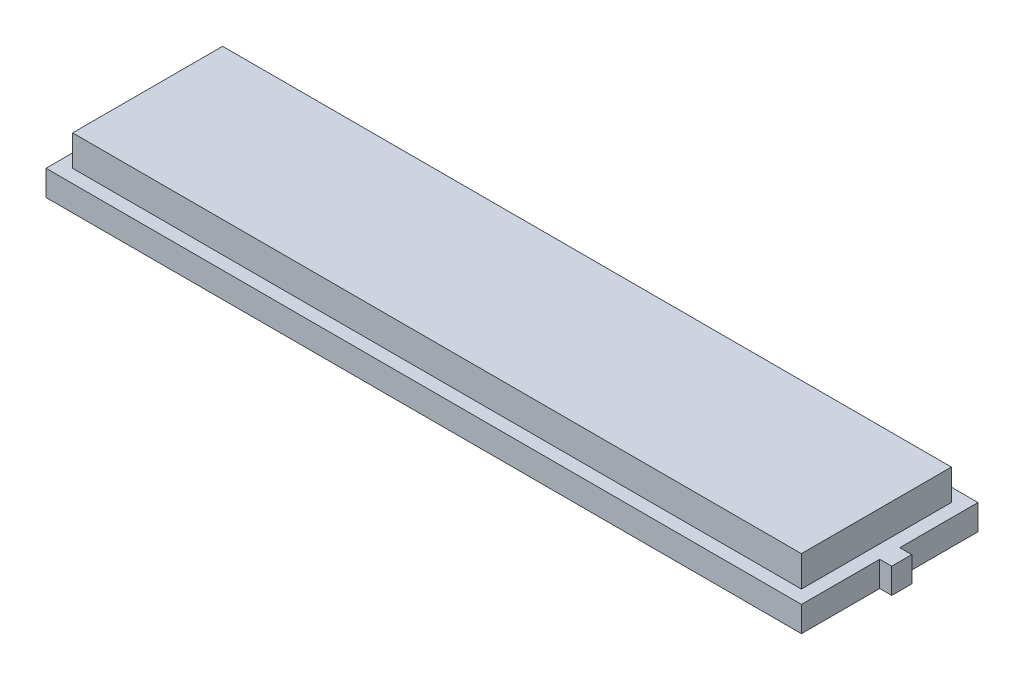
ISO-10303-21;
HEADER;
FILE_DESCRIPTION(('STEP AP214'),'2;1');
FILE_NAME('part.step','',(''),(''),'','','');
FILE_SCHEMA(('AUTOMOTIVE_DESIGN { 1 0 10303 214 1 1 1 1 }'));
ENDSEC;
DATA;
#1=APPLICATION_CONTEXT('core data for automotive mechanical design processes');
#2=APPLICATION_PROTOCOL_DEFINITION('international standard','automotive_design',2000,#1);
#3=PRODUCT_CONTEXT('',#1,'mechanical');
#4=PRODUCT('Part','Part','',(#3));
#5=PRODUCT_RELATED_PRODUCT_CATEGORY('part','',(#4));
#6=PRODUCT_DEFINITION_FORMATION('','',#4);
#7=PRODUCT_DEFINITION_CONTEXT('part definition',#1,'design');
#8=PRODUCT_DEFINITION('design','',#6,#7);
#9=PRODUCT_DEFINITION_SHAPE('','',#8);
#10=(LENGTH_UNIT() NAMED_UNIT(*) SI_UNIT(.MILLI.,.METRE.));
#11=(NAMED_UNIT(*) PLANE_ANGLE_UNIT() SI_UNIT($,.RADIAN.));
#12=(NAMED_UNIT(*) SI_UNIT($,.STERADIAN.) SOLID_ANGLE_UNIT());
#13=UNCERTAINTY_MEASURE_WITH_UNIT(LENGTH_MEASURE(1.E-05),#10,'distance_accuracy_value','');
#14=(GEOMETRIC_REPRESENTATION_CONTEXT(3) GLOBAL_UNCERTAINTY_ASSIGNED_CONTEXT((#13)) GLOBAL_UNIT_ASSIGNED_CONTEXT((#10,
#11,#12)) REPRESENTATION_CONTEXT('',''));
#15=CARTESIAN_POINT('',(0.,0.,0.));
#16=DIRECTION('',(0.,0.,1.));
#17=DIRECTION('',(1.,0.,0.));
#18=AXIS2_PLACEMENT_3D('',#15,#16,#17);
#19=CARTESIAN_POINT('',(0.,1.9,0.));
#20=DIRECTION('',(0.,1.,0.));
#21=DIRECTION('',(0.,0.,1.));
#22=AXIS2_PLACEMENT_3D('',#19,#20,#21);
#23=PLANE('',#22);
#24=DIRECTION('',(0.,0.,1.));
#25=VECTOR('',#24,1.);
#26=CARTESIAN_POINT('',(-28.31,1.9,-6.615));
#27=LINE('',#26,#25);
#28=CARTESIAN_POINT('',(-28.31,1.9,-6.615));
#29=VERTEX_POINT('',#28);
#30=CARTESIAN_POINT('',(-28.31,1.9,6.615));
#31=VERTEX_POINT('',#30);
#32=EDGE_CURVE('E159',#29,#31,#27,.T.);
#33=ORIENTED_EDGE('',*,*,#32,.T.);
#34=DIRECTION('',(1.,0.,0.));
#35=VECTOR('',#34,1.);
#36=CARTESIAN_POINT('',(-28.31,1.9,6.615));
#37=LINE('',#36,#35);
#38=CARTESIAN_POINT('',(28.31,1.9,6.615));
#39=VERTEX_POINT('',#38);
#40=EDGE_CURVE('E99',#31,#39,#37,.T.);
#41=ORIENTED_EDGE('',*,*,#40,.T.);
#42=DIRECTION('',(0.,0.,-1.));
#43=VECTOR('',#42,1.);
#44=CARTESIAN_POINT('',(28.31,1.9,0.75));
#45=LINE('',#44,#43);
#46=CARTESIAN_POINT('',(28.31,1.9,0.75));
#47=VERTEX_POINT('',#46);
#48=EDGE_CURVE('E174',#39,#47,#45,.T.);
#49=ORIENTED_EDGE('',*,*,#48,.T.);
#50=DIRECTION('',(1.,0.,0.));
#51=VECTOR('',#50,1.);
#52=CARTESIAN_POINT('',(29.21,1.9,0.75));
#53=LINE('',#52,#51);
#54=CARTESIAN_POINT('',(29.21,1.9,0.75));
#55=VERTEX_POINT('',#54);
#56=EDGE_CURVE('E186',#47,#55,#53,.T.);
#57=ORIENTED_EDGE('',*,*,#56,.T.);
#58=DIRECTION('',(0.,0.,-1.));
#59=VECTOR('',#58,1.);
#60=CARTESIAN_POINT('',(29.21,1.9,-0.75));
#61=LINE('',#60,#59);
#62=CARTESIAN_POINT('',(29.21,1.9,-0.75));
#63=VERTEX_POINT('',#62);
#64=EDGE_CURVE('E122',#55,#63,#61,.T.);
#65=ORIENTED_EDGE('',*,*,#64,.T.);
#66=DIRECTION('',(-1.,0.,0.));
#67=VECTOR('',#66,1.);
#68=CARTESIAN_POINT('',(28.31,1.9,-0.75));
#69=LINE('',#68,#67);
#70=CARTESIAN_POINT('',(28.31,1.9,-0.75));
#71=VERTEX_POINT('',#70);
#72=EDGE_CURVE('E115',#63,#71,#69,.T.);
#73=ORIENTED_EDGE('',*,*,#72,.T.);
#74=DIRECTION('',(0.,0.,-1.));
#75=VECTOR('',#74,1.);
#76=CARTESIAN_POINT('',(28.31,1.9,-6.615));
#77=LINE('',#76,#75);
#78=CARTESIAN_POINT('',(28.31,1.9,-6.615));
#79=VERTEX_POINT('',#78);
#80=EDGE_CURVE('E119',#71,#79,#77,.T.);
#81=ORIENTED_EDGE('',*,*,#80,.T.);
#82=DIRECTION('',(-1.,0.,0.));
#83=VECTOR('',#82,1.);
#84=CARTESIAN_POINT('',(-28.31,1.9,-6.615));
#85=LINE('',#84,#83);
#86=EDGE_CURVE('E58',#79,#29,#85,.T.);
#87=ORIENTED_EDGE('',*,*,#86,.T.);
#88=EDGE_LOOP('',(#33,#41,#49,#57,#65,#73,#81,#87));
#89=FACE_BOUND('',#88,.T.);
#90=DIRECTION('',(1.,0.,0.));
#91=VECTOR('',#90,1.);
#92=CARTESIAN_POINT('',(-27.31,1.9,5.62));
#93=LINE('',#92,#91);
#94=CARTESIAN_POINT('',(-27.31,1.9,5.62));
#95=VERTEX_POINT('',#94);
#96=CARTESIAN_POINT('',(27.31,1.9,5.62));
#97=VERTEX_POINT('',#96);
#98=EDGE_CURVE('E207',#95,#97,#93,.T.);
#99=ORIENTED_EDGE('',*,*,#98,.F.);
#100=DIRECTION('',(0.,0.,1.));
#101=VECTOR('',#100,1.);
#102=CARTESIAN_POINT('',(-27.31,1.9,-5.62));
#103=LINE('',#102,#101);
#104=CARTESIAN_POINT('',(-27.31,1.9,-5.62));
#105=VERTEX_POINT('',#104);
#106=EDGE_CURVE('E210',#105,#95,#103,.T.);
#107=ORIENTED_EDGE('',*,*,#106,.F.);
#108=DIRECTION('',(-1.,0.,0.));
#109=VECTOR('',#108,1.);
#110=CARTESIAN_POINT('',(-27.31,1.9,-5.62));
#111=LINE('',#110,#109);
#112=CARTESIAN_POINT('',(27.31,1.9,-5.62));
#113=VERTEX_POINT('',#112);
#114=EDGE_CURVE('E202',#113,#105,#111,.T.);
#115=ORIENTED_EDGE('',*,*,#114,.F.);
#116=DIRECTION('',(0.,0.,-1.));
#117=VECTOR('',#116,1.);
#118=CARTESIAN_POINT('',(27.31,1.9,-5.62));
#119=LINE('',#118,#117);
#120=EDGE_CURVE('E205',#97,#113,#119,.T.);
#121=ORIENTED_EDGE('',*,*,#120,.F.);
#122=EDGE_LOOP('',(#99,#107,#115,#121));
#123=FACE_BOUND('',#122,.T.);
#124=ADVANCED_FACE('F34',(#89,#123),#23,.T.);
#125=CARTESIAN_POINT('',(-28.31,1.9,-6.615));
#126=DIRECTION('',(1.,0.,0.));
#127=DIRECTION('',(0.,0.,-1.));
#128=AXIS2_PLACEMENT_3D('',#125,#126,#127);
#129=PLANE('',#128);
#130=DIRECTION('',(0.,0.,1.));
#131=VECTOR('',#130,1.);
#132=CARTESIAN_POINT('',(-28.31,0.,-6.615));
#133=LINE('',#132,#131);
#134=CARTESIAN_POINT('',(-28.31,0.,-6.615));
#135=VERTEX_POINT('',#134);
#136=CARTESIAN_POINT('',(-28.31,0.,6.615));
#137=VERTEX_POINT('',#136);
#138=EDGE_CURVE('E143',#135,#137,#133,.T.);
#139=ORIENTED_EDGE('',*,*,#138,.T.);
#140=DIRECTION('',(0.,-1.,0.));
#141=VECTOR('',#140,1.);
#142=CARTESIAN_POINT('',(-28.31,1.9,6.615));
#143=LINE('',#142,#141);
#144=EDGE_CURVE('E11',#31,#137,#143,.T.);
#145=ORIENTED_EDGE('',*,*,#144,.F.);
#146=ORIENTED_EDGE('',*,*,#32,.F.);
#147=DIRECTION('',(0.,-1.,0.));
#148=VECTOR('',#147,1.);
#149=CARTESIAN_POINT('',(-28.31,1.9,-6.615));
#150=LINE('',#149,#148);
#151=EDGE_CURVE('E139',#29,#135,#150,.T.);
#152=ORIENTED_EDGE('',*,*,#151,.T.);
#153=EDGE_LOOP('',(#139,#145,#146,#152));
#154=FACE_BOUND('',#153,.T.);
#155=ADVANCED_FACE('F36',(#154),#129,.F.);
#156=CARTESIAN_POINT('',(-28.31,1.9,6.615));
#157=DIRECTION('',(0.,0.,-1.));
#158=DIRECTION('',(-1.,0.,0.));
#159=AXIS2_PLACEMENT_3D('',#156,#157,#158);
#160=PLANE('',#159);
#161=DIRECTION('',(1.,0.,0.));
#162=VECTOR('',#161,1.);
#163=CARTESIAN_POINT('',(-28.31,0.,6.615));
#164=LINE('',#163,#162);
#165=CARTESIAN_POINT('',(28.31,0.,6.615));
#166=VERTEX_POINT('',#165);
#167=EDGE_CURVE('E146',#137,#166,#164,.T.);
#168=ORIENTED_EDGE('',*,*,#167,.T.);
#169=DIRECTION('',(0.,-1.,0.));
#170=VECTOR('',#169,1.);
#171=CARTESIAN_POINT('',(28.31,1.9,6.615));
#172=LINE('',#171,#170);
#173=EDGE_CURVE('E42',#39,#166,#172,.T.);
#174=ORIENTED_EDGE('',*,*,#173,.F.);
#175=ORIENTED_EDGE('',*,*,#40,.F.);
#176=ORIENTED_EDGE('',*,*,#144,.T.);
#177=EDGE_LOOP('',(#168,#174,#175,#176));
#178=FACE_BOUND('',#177,.T.);
#179=ADVANCED_FACE('F256',(#178),#160,.F.);
#180=CARTESIAN_POINT('',(28.31,1.9,0.75));
#181=DIRECTION('',(-1.,0.,0.));
#182=DIRECTION('',(0.,0.,1.));
#183=AXIS2_PLACEMENT_3D('',#180,#181,#182);
#184=PLANE('',#183);
#185=DIRECTION('',(0.,0.,-1.));
#186=VECTOR('',#185,1.);
#187=CARTESIAN_POINT('',(28.31,0.,0.75));
#188=LINE('',#187,#186);
#189=CARTESIAN_POINT('',(28.31,0.,0.75));
#190=VERTEX_POINT('',#189);
#191=EDGE_CURVE('E149',#166,#190,#188,.T.);
#192=ORIENTED_EDGE('',*,*,#191,.T.);
#193=DIRECTION('',(0.,-1.,0.));
#194=VECTOR('',#193,1.);
#195=CARTESIAN_POINT('',(28.31,1.9,0.75));
#196=LINE('',#195,#194);
#197=EDGE_CURVE('E166',#47,#190,#196,.T.);
#198=ORIENTED_EDGE('',*,*,#197,.F.);
#199=ORIENTED_EDGE('',*,*,#48,.F.);
#200=ORIENTED_EDGE('',*,*,#173,.T.);
#201=EDGE_LOOP('',(#192,#198,#199,#200));
#202=FACE_BOUND('',#201,.T.);
#203=ADVANCED_FACE('F172',(#202),#184,.F.);
#204=CARTESIAN_POINT('',(29.21,1.9,0.75));
#205=DIRECTION('',(0.,0.,-1.));
#206=DIRECTION('',(-1.,0.,0.));
#207=AXIS2_PLACEMENT_3D('',#204,#205,#206);
#208=PLANE('',#207);
#209=DIRECTION('',(1.,0.,0.));
#210=VECTOR('',#209,1.);
#211=CARTESIAN_POINT('',(29.21,0.,0.75));
#212=LINE('',#211,#210);
#213=CARTESIAN_POINT('',(29.21,0.,0.75));
#214=VERTEX_POINT('',#213);
#215=EDGE_CURVE('E151',#190,#214,#212,.T.);
#216=ORIENTED_EDGE('',*,*,#215,.T.);
#217=DIRECTION('',(0.,-1.,0.));
#218=VECTOR('',#217,1.);
#219=CARTESIAN_POINT('',(29.21,1.9,0.75));
#220=LINE('',#219,#218);
#221=EDGE_CURVE('E163',#55,#214,#220,.T.);
#222=ORIENTED_EDGE('',*,*,#221,.F.);
#223=ORIENTED_EDGE('',*,*,#56,.F.);
#224=ORIENTED_EDGE('',*,*,#197,.T.);
#225=EDGE_LOOP('',(#216,#222,#223,#224));
#226=FACE_BOUND('',#225,.T.);
#227=ADVANCED_FACE('F182',(#226),#208,.F.);
#228=CARTESIAN_POINT('',(29.21,1.9,-0.75));
#229=DIRECTION('',(-1.,0.,0.));
#230=DIRECTION('',(0.,0.,1.));
#231=AXIS2_PLACEMENT_3D('',#228,#229,#230);
#232=PLANE('',#231);
#233=DIRECTION('',(0.,0.,-1.));
#234=VECTOR('',#233,1.);
#235=CARTESIAN_POINT('',(29.21,0.,-0.75));
#236=LINE('',#235,#234);
#237=CARTESIAN_POINT('',(29.21,0.,-0.75));
#238=VERTEX_POINT('',#237);
#239=EDGE_CURVE('E153',#214,#238,#236,.T.);
#240=ORIENTED_EDGE('',*,*,#239,.T.);
#241=DIRECTION('',(0.,-1.,0.));
#242=VECTOR('',#241,1.);
#243=CARTESIAN_POINT('',(29.21,1.9,-0.75));
#244=LINE('',#243,#242);
#245=EDGE_CURVE('E134',#63,#238,#244,.T.);
#246=ORIENTED_EDGE('',*,*,#245,.F.);
#247=ORIENTED_EDGE('',*,*,#64,.F.);
#248=ORIENTED_EDGE('',*,*,#221,.T.);
#249=EDGE_LOOP('',(#240,#246,#247,#248));
#250=FACE_BOUND('',#249,.T.);
#251=ADVANCED_FACE('F185',(#250),#232,.F.);
#252=CARTESIAN_POINT('',(28.31,1.9,-0.75));
#253=DIRECTION('',(0.,0.,1.));
#254=DIRECTION('',(1.,0.,0.));
#255=AXIS2_PLACEMENT_3D('',#252,#253,#254);
#256=PLANE('',#255);
#257=DIRECTION('',(-1.,0.,0.));
#258=VECTOR('',#257,1.);
#259=CARTESIAN_POINT('',(28.31,0.,-0.75));
#260=LINE('',#259,#258);
#261=CARTESIAN_POINT('',(28.31,0.,-0.75));
#262=VERTEX_POINT('',#261);
#263=EDGE_CURVE('E131',#238,#262,#260,.T.);
#264=ORIENTED_EDGE('',*,*,#263,.T.);
#265=DIRECTION('',(0.,-1.,0.));
#266=VECTOR('',#265,1.);
#267=CARTESIAN_POINT('',(28.31,1.9,-0.75));
#268=LINE('',#267,#266);
#269=EDGE_CURVE('E128',#71,#262,#268,.T.);
#270=ORIENTED_EDGE('',*,*,#269,.F.);
#271=ORIENTED_EDGE('',*,*,#72,.F.);
#272=ORIENTED_EDGE('',*,*,#245,.T.);
#273=EDGE_LOOP('',(#264,#270,#271,#272));
#274=FACE_BOUND('',#273,.T.);
#275=ADVANCED_FACE('F129',(#274),#256,.F.);
#276=CARTESIAN_POINT('',(28.31,1.9,-6.615));
#277=DIRECTION('',(-1.,0.,0.));
#278=DIRECTION('',(0.,0.,1.));
#279=AXIS2_PLACEMENT_3D('',#276,#277,#278);
#280=PLANE('',#279);
#281=DIRECTION('',(0.,0.,-1.));
#282=VECTOR('',#281,1.);
#283=CARTESIAN_POINT('',(28.31,0.,-6.615));
#284=LINE('',#283,#282);
#285=CARTESIAN_POINT('',(28.31,0.,-6.615));
#286=VERTEX_POINT('',#285);
#287=EDGE_CURVE('E156',#262,#286,#284,.T.);
#288=ORIENTED_EDGE('',*,*,#287,.T.);
#289=DIRECTION('',(0.,-1.,0.));
#290=VECTOR('',#289,1.);
#291=CARTESIAN_POINT('',(28.31,1.9,-6.615));
#292=LINE('',#291,#290);
#293=EDGE_CURVE('E135',#79,#286,#292,.T.);
#294=ORIENTED_EDGE('',*,*,#293,.F.);
#295=ORIENTED_EDGE('',*,*,#80,.F.);
#296=ORIENTED_EDGE('',*,*,#269,.T.);
#297=EDGE_LOOP('',(#288,#294,#295,#296));
#298=FACE_BOUND('',#297,.T.);
#299=ADVANCED_FACE('F137',(#298),#280,.F.);
#300=CARTESIAN_POINT('',(-28.31,1.9,-6.615));
#301=DIRECTION('',(0.,0.,1.));
#302=DIRECTION('',(1.,0.,0.));
#303=AXIS2_PLACEMENT_3D('',#300,#301,#302);
#304=PLANE('',#303);
#305=DIRECTION('',(-1.,0.,0.));
#306=VECTOR('',#305,1.);
#307=CARTESIAN_POINT('',(-28.31,0.,-6.615));
#308=LINE('',#307,#306);
#309=EDGE_CURVE('E91',#286,#135,#308,.T.);
#310=ORIENTED_EDGE('',*,*,#309,.T.);
#311=ORIENTED_EDGE('',*,*,#151,.F.);
#312=ORIENTED_EDGE('',*,*,#86,.F.);
#313=ORIENTED_EDGE('',*,*,#293,.T.);
#314=EDGE_LOOP('',(#310,#311,#312,#313));
#315=FACE_BOUND('',#314,.T.);
#316=ADVANCED_FACE('F263',(#315),#304,.F.);
#317=CARTESIAN_POINT('',(0.,0.,0.));
#318=DIRECTION('',(0.,1.,0.));
#319=DIRECTION('',(0.,0.,1.));
#320=AXIS2_PLACEMENT_3D('',#317,#318,#319);
#321=PLANE('',#320);
#322=ORIENTED_EDGE('',*,*,#138,.F.);
#323=ORIENTED_EDGE('',*,*,#309,.F.);
#324=ORIENTED_EDGE('',*,*,#287,.F.);
#325=ORIENTED_EDGE('',*,*,#263,.F.);
#326=ORIENTED_EDGE('',*,*,#239,.F.);
#327=ORIENTED_EDGE('',*,*,#215,.F.);
#328=ORIENTED_EDGE('',*,*,#191,.F.);
#329=ORIENTED_EDGE('',*,*,#167,.F.);
#330=EDGE_LOOP('',(#322,#323,#324,#325,#326,#327,#328,#329));
#331=FACE_BOUND('',#330,.T.);
#332=ADVANCED_FACE('F178',(#331),#321,.F.);
#333=CARTESIAN_POINT('',(-27.31,4.2,-5.62));
#334=DIRECTION('',(1.,0.,0.));
#335=DIRECTION('',(0.,0.,-1.));
#336=AXIS2_PLACEMENT_3D('',#333,#334,#335);
#337=PLANE('',#336);
#338=ORIENTED_EDGE('',*,*,#106,.T.);
#339=DIRECTION('',(0.,-1.,0.));
#340=VECTOR('',#339,1.);
#341=CARTESIAN_POINT('',(-27.31,4.2,5.62));
#342=LINE('',#341,#340);
#343=CARTESIAN_POINT('',(-27.31,4.2,5.62));
#344=VERTEX_POINT('',#343);
#345=EDGE_CURVE('E147',#344,#95,#342,.T.);
#346=ORIENTED_EDGE('',*,*,#345,.F.);
#347=DIRECTION('',(0.,0.,1.));
#348=VECTOR('',#347,1.);
#349=CARTESIAN_POINT('',(-27.31,4.2,-5.62));
#350=LINE('',#349,#348);
#351=CARTESIAN_POINT('',(-27.31,4.2,-5.62));
#352=VERTEX_POINT('',#351);
#353=EDGE_CURVE('E204',#352,#344,#350,.T.);
#354=ORIENTED_EDGE('',*,*,#353,.F.);
#355=DIRECTION('',(0.,-1.,0.));
#356=VECTOR('',#355,1.);
#357=CARTESIAN_POINT('',(-27.31,4.2,-5.62));
#358=LINE('',#357,#356);
#359=EDGE_CURVE('E198',#352,#105,#358,.T.);
#360=ORIENTED_EDGE('',*,*,#359,.T.);
#361=EDGE_LOOP('',(#338,#346,#354,#360));
#362=FACE_BOUND('',#361,.T.);
#363=ADVANCED_FACE('F233',(#362),#337,.F.);
#364=CARTESIAN_POINT('',(-27.31,4.2,5.62));
#365=DIRECTION('',(0.,0.,-1.));
#366=DIRECTION('',(-1.,0.,0.));
#367=AXIS2_PLACEMENT_3D('',#364,#365,#366);
#368=PLANE('',#367);
#369=ORIENTED_EDGE('',*,*,#98,.T.);
#370=DIRECTION('',(0.,-1.,0.));
#371=VECTOR('',#370,1.);
#372=CARTESIAN_POINT('',(27.31,4.2,5.62));
#373=LINE('',#372,#371);
#374=CARTESIAN_POINT('',(27.31,4.2,5.62));
#375=VERTEX_POINT('',#374);
#376=EDGE_CURVE('E194',#375,#97,#373,.T.);
#377=ORIENTED_EDGE('',*,*,#376,.F.);
#378=DIRECTION('',(1.,0.,0.));
#379=VECTOR('',#378,1.);
#380=CARTESIAN_POINT('',(-27.31,4.2,5.62));
#381=LINE('',#380,#379);
#382=EDGE_CURVE('E218',#344,#375,#381,.T.);
#383=ORIENTED_EDGE('',*,*,#382,.F.);
#384=ORIENTED_EDGE('',*,*,#345,.T.);
#385=EDGE_LOOP('',(#369,#377,#383,#384));
#386=FACE_BOUND('',#385,.T.);
#387=ADVANCED_FACE('F238',(#386),#368,.F.);
#388=CARTESIAN_POINT('',(27.31,4.2,-5.62));
#389=DIRECTION('',(-1.,0.,0.));
#390=DIRECTION('',(0.,0.,1.));
#391=AXIS2_PLACEMENT_3D('',#388,#389,#390);
#392=PLANE('',#391);
#393=ORIENTED_EDGE('',*,*,#120,.T.);
#394=DIRECTION('',(0.,-1.,0.));
#395=VECTOR('',#394,1.);
#396=CARTESIAN_POINT('',(27.31,4.2,-5.62));
#397=LINE('',#396,#395);
#398=CARTESIAN_POINT('',(27.31,4.2,-5.62));
#399=VERTEX_POINT('',#398);
#400=EDGE_CURVE('E49',#399,#113,#397,.T.);
#401=ORIENTED_EDGE('',*,*,#400,.F.);
#402=DIRECTION('',(0.,0.,-1.));
#403=VECTOR('',#402,1.);
#404=CARTESIAN_POINT('',(27.31,4.2,-5.62));
#405=LINE('',#404,#403);
#406=EDGE_CURVE('E215',#375,#399,#405,.T.);
#407=ORIENTED_EDGE('',*,*,#406,.F.);
#408=ORIENTED_EDGE('',*,*,#376,.T.);
#409=EDGE_LOOP('',(#393,#401,#407,#408));
#410=FACE_BOUND('',#409,.T.);
#411=ADVANCED_FACE('F247',(#410),#392,.F.);
#412=CARTESIAN_POINT('',(-27.31,4.2,-5.62));
#413=DIRECTION('',(0.,0.,1.));
#414=DIRECTION('',(1.,0.,0.));
#415=AXIS2_PLACEMENT_3D('',#412,#413,#414);
#416=PLANE('',#415);
#417=ORIENTED_EDGE('',*,*,#114,.T.);
#418=ORIENTED_EDGE('',*,*,#359,.F.);
#419=DIRECTION('',(-1.,0.,0.));
#420=VECTOR('',#419,1.);
#421=CARTESIAN_POINT('',(-27.31,4.2,-5.62));
#422=LINE('',#421,#420);
#423=EDGE_CURVE('E201',#399,#352,#422,.T.);
#424=ORIENTED_EDGE('',*,*,#423,.F.);
#425=ORIENTED_EDGE('',*,*,#400,.T.);
#426=EDGE_LOOP('',(#417,#418,#424,#425));
#427=FACE_BOUND('',#426,.T.);
#428=ADVANCED_FACE('F250',(#427),#416,.F.);
#429=CARTESIAN_POINT('',(0.,4.2,0.));
#430=DIRECTION('',(0.,1.,0.));
#431=DIRECTION('',(0.,0.,1.));
#432=AXIS2_PLACEMENT_3D('',#429,#430,#431);
#433=PLANE('',#432);
#434=ORIENTED_EDGE('',*,*,#353,.T.);
#435=ORIENTED_EDGE('',*,*,#382,.T.);
#436=ORIENTED_EDGE('',*,*,#406,.T.);
#437=ORIENTED_EDGE('',*,*,#423,.T.);
#438=EDGE_LOOP('',(#434,#435,#436,#437));
#439=FACE_BOUND('',#438,.T.);
#440=ADVANCED_FACE('F226',(#439),#433,.T.);
#441=CLOSED_SHELL('',(#124,#155,#179,#203,#227,#251,#275,#299,#316,#332,#363,#387,#411,#428,#440));
#442=MANIFOLD_SOLID_BREP('B2',#441);
#443=ADVANCED_BREP_SHAPE_REPRESENTATION('',(#18,#442),#14);
#444=SHAPE_DEFINITION_REPRESENTATION(#9,#443);
ENDSEC;
END-ISO-10303-21;
